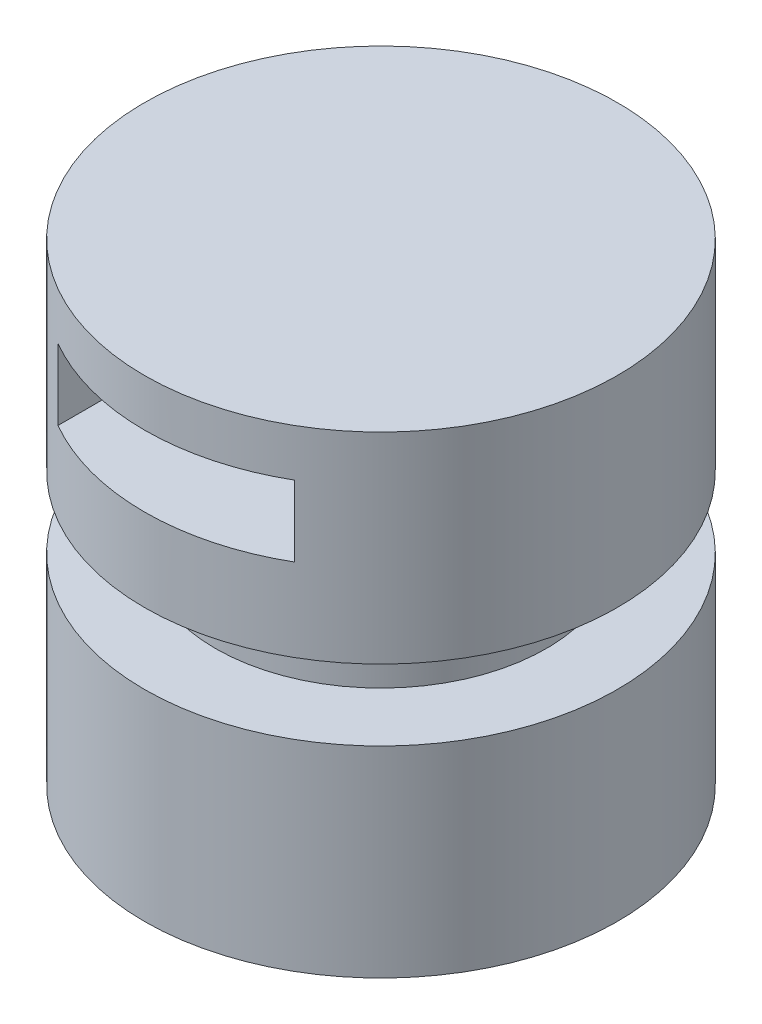
ISO-10303-21;
HEADER;
FILE_DESCRIPTION(('STEP AP214'),'2;1');
FILE_NAME('part.step','',(''),(''),'','','');
FILE_SCHEMA(('AUTOMOTIVE_DESIGN { 1 0 10303 214 1 1 1 1 }'));
ENDSEC;
DATA;
#1=APPLICATION_CONTEXT('core data for automotive mechanical design processes');
#2=APPLICATION_PROTOCOL_DEFINITION('international standard','automotive_design',2000,#1);
#3=PRODUCT_CONTEXT('',#1,'mechanical');
#4=PRODUCT('Part','Part','',(#3));
#5=PRODUCT_RELATED_PRODUCT_CATEGORY('part','',(#4));
#6=PRODUCT_DEFINITION_FORMATION('','',#4);
#7=PRODUCT_DEFINITION_CONTEXT('part definition',#1,'design');
#8=PRODUCT_DEFINITION('design','',#6,#7);
#9=PRODUCT_DEFINITION_SHAPE('','',#8);
#10=(LENGTH_UNIT() NAMED_UNIT(*) SI_UNIT(.MILLI.,.METRE.));
#11=(NAMED_UNIT(*) PLANE_ANGLE_UNIT() SI_UNIT($,.RADIAN.));
#12=(NAMED_UNIT(*) SI_UNIT($,.STERADIAN.) SOLID_ANGLE_UNIT());
#13=UNCERTAINTY_MEASURE_WITH_UNIT(LENGTH_MEASURE(1.E-05),#10,'distance_accuracy_value','');
#14=(GEOMETRIC_REPRESENTATION_CONTEXT(3) GLOBAL_UNCERTAINTY_ASSIGNED_CONTEXT((#13)) GLOBAL_UNIT_ASSIGNED_CONTEXT((#10,
#11,#12)) REPRESENTATION_CONTEXT('',''));
#15=CARTESIAN_POINT('',(0.,0.,0.));
#16=DIRECTION('',(0.,0.,1.));
#17=DIRECTION('',(1.,0.,0.));
#18=AXIS2_PLACEMENT_3D('',#15,#16,#17);
#19=CARTESIAN_POINT('',(0.,200.,0.));
#20=DIRECTION('',(0.,-1.,0.));
#21=DIRECTION('',(0.,0.,-1.));
#22=AXIS2_PLACEMENT_3D('',#19,#20,#21);
#23=CYLINDRICAL_SURFACE('',#22,100.);
#24=CARTESIAN_POINT('',(0.,0.,0.));
#25=DIRECTION('',(0.,1.,0.));
#26=DIRECTION('',(0.,0.,1.));
#27=AXIS2_PLACEMENT_3D('',#24,#25,#26);
#28=CIRCLE('',#27,100.);
#29=CARTESIAN_POINT('',(0.,0.,100.));
#30=VERTEX_POINT('',#29);
#31=EDGE_CURVE('E123',#30,#30,#28,.T.);
#32=ORIENTED_EDGE('',*,*,#31,.T.);
#33=EDGE_LOOP('',(#32));
#34=FACE_BOUND('',#33,.T.);
#35=CARTESIAN_POINT('',(0.,85.,0.));
#36=DIRECTION('',(0.,1.,0.));
#37=DIRECTION('',(0.,0.,1.));
#38=AXIS2_PLACEMENT_3D('',#35,#36,#37);
#39=CIRCLE('',#38,100.);
#40=CARTESIAN_POINT('',(0.,85.,100.));
#41=VERTEX_POINT('',#40);
#42=EDGE_CURVE('E120',#41,#41,#39,.T.);
#43=ORIENTED_EDGE('',*,*,#42,.F.);
#44=EDGE_LOOP('',(#43));
#45=FACE_BOUND('',#44,.T.);
#46=ADVANCED_FACE('F37',(#34,#45),#23,.T.);
#47=CARTESIAN_POINT('',(0.,0.,0.));
#48=DIRECTION('',(0.,1.,0.));
#49=DIRECTION('',(0.,0.,1.));
#50=AXIS2_PLACEMENT_3D('',#47,#48,#49);
#51=PLANE('',#50);
#52=ORIENTED_EDGE('',*,*,#31,.F.);
#53=EDGE_LOOP('',(#52));
#54=FACE_BOUND('',#53,.T.);
#55=ADVANCED_FACE('F130',(#54),#51,.F.);
#56=CARTESIAN_POINT('',(0.,85.,0.));
#57=DIRECTION('',(0.,1.,0.));
#58=DIRECTION('',(0.,0.,1.));
#59=AXIS2_PLACEMENT_3D('',#56,#57,#58);
#60=PLANE('',#59);
#61=ORIENTED_EDGE('',*,*,#42,.T.);
#62=EDGE_LOOP('',(#61));
#63=FACE_BOUND('',#62,.T.);
#64=CARTESIAN_POINT('',(0.,85.,0.));
#65=DIRECTION('',(0.,1.,0.));
#66=DIRECTION('',(0.,0.,1.));
#67=AXIS2_PLACEMENT_3D('',#64,#65,#66);
#68=CIRCLE('',#67,70.);
#69=CARTESIAN_POINT('',(0.,85.,70.));
#70=VERTEX_POINT('',#69);
#71=EDGE_CURVE('E110',#70,#70,#68,.T.);
#72=ORIENTED_EDGE('',*,*,#71,.F.);
#73=EDGE_LOOP('',(#72));
#74=FACE_BOUND('',#73,.T.);
#75=ADVANCED_FACE('F132',(#63,#74),#60,.T.);
#76=CARTESIAN_POINT('',(0.,115.,0.));
#77=DIRECTION('',(0.,-1.,0.));
#78=DIRECTION('',(0.,0.,-1.));
#79=AXIS2_PLACEMENT_3D('',#76,#77,#78);
#80=PLANE('',#79);
#81=CARTESIAN_POINT('',(0.,115.,0.));
#82=DIRECTION('',(0.,1.,0.));
#83=DIRECTION('',(0.,0.,1.));
#84=AXIS2_PLACEMENT_3D('',#81,#82,#83);
#85=CIRCLE('',#84,70.);
#86=CARTESIAN_POINT('',(0.,115.,70.));
#87=VERTEX_POINT('',#86);
#88=EDGE_CURVE('E113',#87,#87,#85,.T.);
#89=ORIENTED_EDGE('',*,*,#88,.T.);
#90=EDGE_LOOP('',(#89));
#91=FACE_BOUND('',#90,.T.);
#92=CARTESIAN_POINT('',(0.,115.,0.));
#93=DIRECTION('',(0.,1.,0.));
#94=DIRECTION('',(0.,0.,1.));
#95=AXIS2_PLACEMENT_3D('',#92,#93,#94);
#96=CIRCLE('',#95,100.);
#97=CARTESIAN_POINT('',(0.,115.,100.));
#98=VERTEX_POINT('',#97);
#99=EDGE_CURVE('E117',#98,#98,#96,.T.);
#100=ORIENTED_EDGE('',*,*,#99,.F.);
#101=EDGE_LOOP('',(#100));
#102=FACE_BOUND('',#101,.T.);
#103=ADVANCED_FACE('F137',(#91,#102),#80,.T.);
#104=CARTESIAN_POINT('',(0.,235.170477906641,0.));
#105=DIRECTION('',(0.,1.,0.));
#106=DIRECTION('',(0.,0.,1.));
#107=AXIS2_PLACEMENT_3D('',#104,#105,#106);
#108=CYLINDRICAL_SURFACE('',#107,70.);
#109=ORIENTED_EDGE('',*,*,#71,.T.);
#110=EDGE_LOOP('',(#109));
#111=FACE_BOUND('',#110,.T.);
#112=ORIENTED_EDGE('',*,*,#88,.F.);
#113=EDGE_LOOP('',(#112));
#114=FACE_BOUND('',#113,.T.);
#115=ADVANCED_FACE('F143',(#111,#114),#108,.T.);
#116=CARTESIAN_POINT('',(0.,200.,0.));
#117=DIRECTION('',(0.,1.,0.));
#118=DIRECTION('',(0.,0.,1.));
#119=AXIS2_PLACEMENT_3D('',#116,#117,#118);
#120=PLANE('',#119);
#121=CARTESIAN_POINT('',(0.,200.,0.));
#122=DIRECTION('',(0.,1.,0.));
#123=DIRECTION('',(0.,0.,1.));
#124=AXIS2_PLACEMENT_3D('',#121,#122,#123);
#125=CIRCLE('',#124,100.);
#126=CARTESIAN_POINT('',(0.,200.,100.));
#127=VERTEX_POINT('',#126);
#128=EDGE_CURVE('E80',#127,#127,#125,.T.);
#129=ORIENTED_EDGE('',*,*,#128,.T.);
#130=EDGE_LOOP('',(#129));
#131=FACE_BOUND('',#130,.T.);
#132=ADVANCED_FACE('F141',(#131),#120,.T.);
#133=CARTESIAN_POINT('',(0.,150.,0.));
#134=DIRECTION('',(0.,-1.,0.));
#135=DIRECTION('',(0.,0.,-1.));
#136=AXIS2_PLACEMENT_3D('',#133,#134,#135);
#137=CIRCLE('',#136,100.);
#138=CARTESIAN_POINT('',(50.,150.,86.6025403784439));
#139=VERTEX_POINT('',#138);
#140=CARTESIAN_POINT('',(-50.,150.,86.6025403784439));
#141=VERTEX_POINT('',#140);
#142=EDGE_CURVE('E44',#139,#141,#137,.T.);
#143=ORIENTED_EDGE('',*,*,#142,.T.);
#144=DIRECTION('',(0.,-1.,0.));
#145=VECTOR('',#144,1.);
#146=CARTESIAN_POINT('',(-50.,200.,86.6025403784439));
#147=LINE('',#146,#145);
#148=CARTESIAN_POINT('',(-50.,180.,86.6025403784439));
#149=VERTEX_POINT('',#148);
#150=EDGE_CURVE('E11',#141,#149,#147,.F.);
#151=ORIENTED_EDGE('',*,*,#150,.T.);
#152=CARTESIAN_POINT('',(0.,180.,0.));
#153=DIRECTION('',(0.,1.,0.));
#154=DIRECTION('',(-1.,0.,0.));
#155=AXIS2_PLACEMENT_3D('',#152,#153,#154);
#156=CIRCLE('',#155,100.);
#157=CARTESIAN_POINT('',(50.,180.,86.6025403784439));
#158=VERTEX_POINT('',#157);
#159=EDGE_CURVE('E82',#149,#158,#156,.T.);
#160=ORIENTED_EDGE('',*,*,#159,.T.);
#161=DIRECTION('',(0.,-1.,0.));
#162=VECTOR('',#161,1.);
#163=CARTESIAN_POINT('',(50.,200.,86.6025403784439));
#164=LINE('',#163,#162);
#165=EDGE_CURVE('E88',#158,#139,#164,.T.);
#166=ORIENTED_EDGE('',*,*,#165,.T.);
#167=EDGE_LOOP('',(#143,#151,#160,#166));
#168=FACE_BOUND('',#167,.T.);
#169=CARTESIAN_POINT('',(50.,180.,-86.6025403784439));
#170=VERTEX_POINT('',#169);
#171=CARTESIAN_POINT('',(-50.,180.,-86.6025403784439));
#172=VERTEX_POINT('',#171);
#173=EDGE_CURVE('E74',#170,#172,#156,.T.);
#174=ORIENTED_EDGE('',*,*,#173,.T.);
#175=DIRECTION('',(0.,-1.,0.));
#176=VECTOR('',#175,1.);
#177=CARTESIAN_POINT('',(-50.,200.,-86.6025403784439));
#178=LINE('',#177,#176);
#179=CARTESIAN_POINT('',(-50.,150.,-86.6025403784439));
#180=VERTEX_POINT('',#179);
#181=EDGE_CURVE('E97',#172,#180,#178,.T.);
#182=ORIENTED_EDGE('',*,*,#181,.T.);
#183=CARTESIAN_POINT('',(50.,150.,-86.6025403784439));
#184=VERTEX_POINT('',#183);
#185=EDGE_CURVE('E95',#180,#184,#137,.T.);
#186=ORIENTED_EDGE('',*,*,#185,.T.);
#187=DIRECTION('',(0.,-1.,0.));
#188=VECTOR('',#187,1.);
#189=CARTESIAN_POINT('',(50.,200.,-86.6025403784439));
#190=LINE('',#189,#188);
#191=EDGE_CURVE('E79',#184,#170,#190,.F.);
#192=ORIENTED_EDGE('',*,*,#191,.T.);
#193=EDGE_LOOP('',(#174,#182,#186,#192));
#194=FACE_BOUND('',#193,.T.);
#195=ORIENTED_EDGE('',*,*,#128,.F.);
#196=EDGE_LOOP('',(#195));
#197=FACE_BOUND('',#196,.T.);
#198=ORIENTED_EDGE('',*,*,#99,.T.);
#199=EDGE_LOOP('',(#198));
#200=FACE_BOUND('',#199,.T.);
#201=ADVANCED_FACE('F93',(#168,#194,#197,#200),#23,.T.);
#202=CARTESIAN_POINT('',(-50.,150.,200.));
#203=DIRECTION('',(-1.,0.,0.));
#204=DIRECTION('',(0.,0.,1.));
#205=AXIS2_PLACEMENT_3D('',#202,#203,#204);
#206=PLANE('',#205);
#207=DIRECTION('',(0.,0.,-1.));
#208=VECTOR('',#207,1.);
#209=CARTESIAN_POINT('',(-50.,180.,200.));
#210=LINE('',#209,#208);
#211=EDGE_CURVE('E56',#149,#172,#210,.T.);
#212=ORIENTED_EDGE('',*,*,#211,.F.);
#213=ORIENTED_EDGE('',*,*,#150,.F.);
#214=DIRECTION('',(0.,0.,-1.));
#215=VECTOR('',#214,1.);
#216=CARTESIAN_POINT('',(-50.,150.,200.));
#217=LINE('',#216,#215);
#218=EDGE_CURVE('E114',#141,#180,#217,.T.);
#219=ORIENTED_EDGE('',*,*,#218,.T.);
#220=ORIENTED_EDGE('',*,*,#181,.F.);
#221=EDGE_LOOP('',(#212,#213,#219,#220));
#222=FACE_BOUND('',#221,.T.);
#223=ADVANCED_FACE('F104',(#222),#206,.F.);
#224=CARTESIAN_POINT('',(50.,150.,200.));
#225=DIRECTION('',(0.,-1.,0.));
#226=DIRECTION('',(0.,0.,-1.));
#227=AXIS2_PLACEMENT_3D('',#224,#225,#226);
#228=PLANE('',#227);
#229=DIRECTION('',(0.,0.,-1.));
#230=VECTOR('',#229,1.);
#231=CARTESIAN_POINT('',(50.,150.,200.));
#232=LINE('',#231,#230);
#233=EDGE_CURVE('E90',#139,#184,#232,.T.);
#234=ORIENTED_EDGE('',*,*,#233,.T.);
#235=ORIENTED_EDGE('',*,*,#185,.F.);
#236=ORIENTED_EDGE('',*,*,#218,.F.);
#237=ORIENTED_EDGE('',*,*,#142,.F.);
#238=EDGE_LOOP('',(#234,#235,#236,#237));
#239=FACE_BOUND('',#238,.T.);
#240=ADVANCED_FACE('F154',(#239),#228,.F.);
#241=CARTESIAN_POINT('',(50.,180.,200.));
#242=DIRECTION('',(1.,0.,0.));
#243=DIRECTION('',(0.,1.,0.));
#244=AXIS2_PLACEMENT_3D('',#241,#242,#243);
#245=PLANE('',#244);
#246=DIRECTION('',(0.,0.,-1.));
#247=VECTOR('',#246,1.);
#248=CARTESIAN_POINT('',(50.,180.,200.));
#249=LINE('',#248,#247);
#250=EDGE_CURVE('E51',#158,#170,#249,.T.);
#251=ORIENTED_EDGE('',*,*,#250,.T.);
#252=ORIENTED_EDGE('',*,*,#191,.F.);
#253=ORIENTED_EDGE('',*,*,#233,.F.);
#254=ORIENTED_EDGE('',*,*,#165,.F.);
#255=EDGE_LOOP('',(#251,#252,#253,#254));
#256=FACE_BOUND('',#255,.T.);
#257=ADVANCED_FACE('F84',(#256),#245,.F.);
#258=CARTESIAN_POINT('',(0.,180.,200.));
#259=DIRECTION('',(0.,1.,0.));
#260=DIRECTION('',(-1.,0.,0.));
#261=AXIS2_PLACEMENT_3D('',#258,#259,#260);
#262=PLANE('',#261);
#263=ORIENTED_EDGE('',*,*,#211,.T.);
#264=ORIENTED_EDGE('',*,*,#173,.F.);
#265=ORIENTED_EDGE('',*,*,#250,.F.);
#266=ORIENTED_EDGE('',*,*,#159,.F.);
#267=EDGE_LOOP('',(#263,#264,#265,#266));
#268=FACE_BOUND('',#267,.T.);
#269=ADVANCED_FACE('F75',(#268),#262,.F.);
#270=CLOSED_SHELL('',(#46,#55,#75,#103,#115,#132,#201,#223,#240,#257,#269));
#271=MANIFOLD_SOLID_BREP('B2',#270);
#272=ADVANCED_BREP_SHAPE_REPRESENTATION('',(#18,#271),#14);
#273=SHAPE_DEFINITION_REPRESENTATION(#9,#272);
ENDSEC;
END-ISO-10303-21;
